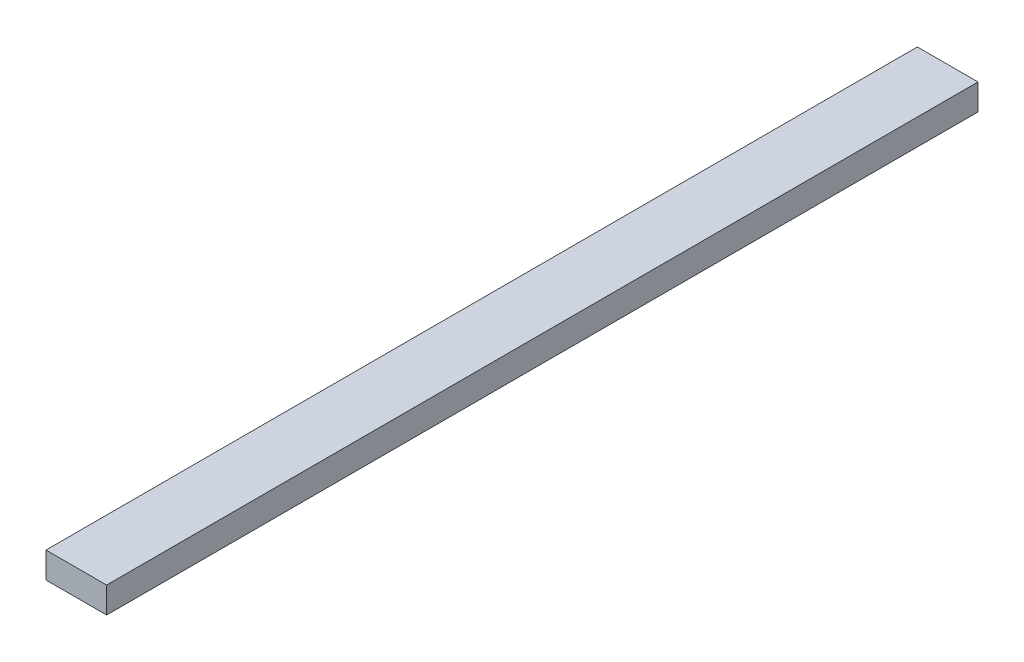
ISO-10303-21;
HEADER;
FILE_DESCRIPTION(('STEP AP214'),'2;1');
FILE_NAME('part.step','',(''),(''),'','','');
FILE_SCHEMA(('AUTOMOTIVE_DESIGN { 1 0 10303 214 1 1 1 1 }'));
ENDSEC;
DATA;
#1=APPLICATION_CONTEXT('core data for automotive mechanical design processes');
#2=APPLICATION_PROTOCOL_DEFINITION('international standard','automotive_design',2000,#1);
#3=PRODUCT_CONTEXT('',#1,'mechanical');
#4=PRODUCT('Part','Part','',(#3));
#5=PRODUCT_RELATED_PRODUCT_CATEGORY('part','',(#4));
#6=PRODUCT_DEFINITION_FORMATION('','',#4);
#7=PRODUCT_DEFINITION_CONTEXT('part definition',#1,'design');
#8=PRODUCT_DEFINITION('design','',#6,#7);
#9=PRODUCT_DEFINITION_SHAPE('','',#8);
#10=(LENGTH_UNIT() NAMED_UNIT(*) SI_UNIT(.MILLI.,.METRE.));
#11=(NAMED_UNIT(*) PLANE_ANGLE_UNIT() SI_UNIT($,.RADIAN.));
#12=(NAMED_UNIT(*) SI_UNIT($,.STERADIAN.) SOLID_ANGLE_UNIT());
#13=UNCERTAINTY_MEASURE_WITH_UNIT(LENGTH_MEASURE(1.E-05),#10,'distance_accuracy_value','');
#14=(GEOMETRIC_REPRESENTATION_CONTEXT(3) GLOBAL_UNCERTAINTY_ASSIGNED_CONTEXT((#13)) GLOBAL_UNIT_ASSIGNED_CONTEXT((#10,
#11,#12)) REPRESENTATION_CONTEXT('',''));
#15=CARTESIAN_POINT('',(0.,0.,0.));
#16=DIRECTION('',(0.,0.,1.));
#17=DIRECTION('',(1.,0.,0.));
#18=AXIS2_PLACEMENT_3D('',#15,#16,#17);
#19=CARTESIAN_POINT('',(-44.4500000000001,0.,638.899999947));
#20=DIRECTION('',(0.,-1.,0.));
#21=DIRECTION('',(1.,0.,0.));
#22=AXIS2_PLACEMENT_3D('',#19,#20,#21);
#23=PLANE('',#22);
#24=DIRECTION('',(-1.,0.,0.));
#25=VECTOR('',#24,1.);
#26=CARTESIAN_POINT('',(-44.4500000000001,0.,-638.899999947));
#27=LINE('',#26,#25);
#28=CARTESIAN_POINT('',(44.4500000000001,0.,-638.899999947));
#29=VERTEX_POINT('',#28);
#30=CARTESIAN_POINT('',(-44.4500000000001,0.,-638.899999947));
#31=VERTEX_POINT('',#30);
#32=EDGE_CURVE('E97',#29,#31,#27,.T.);
#33=ORIENTED_EDGE('',*,*,#32,.T.);
#34=DIRECTION('',(0.,0.,-1.));
#35=VECTOR('',#34,1.);
#36=CARTESIAN_POINT('',(-44.4500000000001,0.,638.899999947));
#37=LINE('',#36,#35);
#38=CARTESIAN_POINT('',(-44.4500000000001,0.,638.899999947));
#39=VERTEX_POINT('',#38);
#40=EDGE_CURVE('E11',#39,#31,#37,.T.);
#41=ORIENTED_EDGE('',*,*,#40,.F.);
#42=DIRECTION('',(-1.,0.,0.));
#43=VECTOR('',#42,1.);
#44=CARTESIAN_POINT('',(-44.4500000000001,0.,638.899999947));
#45=LINE('',#44,#43);
#46=CARTESIAN_POINT('',(44.4500000000001,0.,638.899999947));
#47=VERTEX_POINT('',#46);
#48=EDGE_CURVE('E85',#47,#39,#45,.T.);
#49=ORIENTED_EDGE('',*,*,#48,.F.);
#50=DIRECTION('',(0.,0.,-1.));
#51=VECTOR('',#50,1.);
#52=CARTESIAN_POINT('',(44.4500000000001,0.,638.899999947));
#53=LINE('',#52,#51);
#54=EDGE_CURVE('E93',#47,#29,#53,.T.);
#55=ORIENTED_EDGE('',*,*,#54,.T.);
#56=EDGE_LOOP('',(#33,#41,#49,#55));
#57=FACE_BOUND('',#56,.T.);
#58=ADVANCED_FACE('F34',(#57),#23,.F.);
#59=CARTESIAN_POINT('',(-44.4500000000001,-38.0999999999999,638.899999947));
#60=DIRECTION('',(1.,0.,0.));
#61=DIRECTION('',(0.,0.,-1.));
#62=AXIS2_PLACEMENT_3D('',#59,#60,#61);
#63=PLANE('',#62);
#64=DIRECTION('',(0.,-1.,0.));
#65=VECTOR('',#64,1.);
#66=CARTESIAN_POINT('',(-44.4500000000001,-38.0999999999999,-638.899999947));
#67=LINE('',#66,#65);
#68=CARTESIAN_POINT('',(-44.4500000000001,-38.0999999999999,-638.899999947));
#69=VERTEX_POINT('',#68);
#70=EDGE_CURVE('E89',#31,#69,#67,.T.);
#71=ORIENTED_EDGE('',*,*,#70,.T.);
#72=DIRECTION('',(0.,0.,-1.));
#73=VECTOR('',#72,1.);
#74=CARTESIAN_POINT('',(-44.4500000000001,-38.0999999999999,638.899999947));
#75=LINE('',#74,#73);
#76=CARTESIAN_POINT('',(-44.4500000000001,-38.0999999999999,638.899999947));
#77=VERTEX_POINT('',#76);
#78=EDGE_CURVE('E42',#77,#69,#75,.T.);
#79=ORIENTED_EDGE('',*,*,#78,.F.);
#80=DIRECTION('',(0.,-1.,0.));
#81=VECTOR('',#80,1.);
#82=CARTESIAN_POINT('',(-44.4500000000001,-38.0999999999999,638.899999947));
#83=LINE('',#82,#81);
#84=EDGE_CURVE('E80',#39,#77,#83,.T.);
#85=ORIENTED_EDGE('',*,*,#84,.F.);
#86=ORIENTED_EDGE('',*,*,#40,.T.);
#87=EDGE_LOOP('',(#71,#79,#85,#86));
#88=FACE_BOUND('',#87,.T.);
#89=ADVANCED_FACE('F88',(#88),#63,.F.);
#90=CARTESIAN_POINT('',(44.4500000000001,-38.0999999999999,638.899999947));
#91=DIRECTION('',(0.,1.,0.));
#92=DIRECTION('',(-1.,0.,0.));
#93=AXIS2_PLACEMENT_3D('',#90,#91,#92);
#94=PLANE('',#93);
#95=DIRECTION('',(1.,0.,0.));
#96=VECTOR('',#95,1.);
#97=CARTESIAN_POINT('',(44.4500000000001,-38.0999999999999,-638.899999947));
#98=LINE('',#97,#96);
#99=CARTESIAN_POINT('',(44.4500000000001,-38.0999999999999,-638.899999947));
#100=VERTEX_POINT('',#99);
#101=EDGE_CURVE('E67',#69,#100,#98,.T.);
#102=ORIENTED_EDGE('',*,*,#101,.T.);
#103=DIRECTION('',(0.,0.,-1.));
#104=VECTOR('',#103,1.);
#105=CARTESIAN_POINT('',(44.4500000000001,-38.0999999999999,638.899999947));
#106=LINE('',#105,#104);
#107=CARTESIAN_POINT('',(44.4500000000001,-38.0999999999999,638.899999947));
#108=VERTEX_POINT('',#107);
#109=EDGE_CURVE('E90',#108,#100,#106,.T.);
#110=ORIENTED_EDGE('',*,*,#109,.F.);
#111=DIRECTION('',(1.,0.,0.));
#112=VECTOR('',#111,1.);
#113=CARTESIAN_POINT('',(44.4500000000001,-38.0999999999999,638.899999947));
#114=LINE('',#113,#112);
#115=EDGE_CURVE('E83',#77,#108,#114,.T.);
#116=ORIENTED_EDGE('',*,*,#115,.F.);
#117=ORIENTED_EDGE('',*,*,#78,.T.);
#118=EDGE_LOOP('',(#102,#110,#116,#117));
#119=FACE_BOUND('',#118,.T.);
#120=ADVANCED_FACE('F91',(#119),#94,.F.);
#121=CARTESIAN_POINT('',(44.4500000000001,0.,638.899999947));
#122=DIRECTION('',(-1.,0.,0.));
#123=DIRECTION('',(0.,0.,1.));
#124=AXIS2_PLACEMENT_3D('',#121,#122,#123);
#125=PLANE('',#124);
#126=DIRECTION('',(0.,1.,0.));
#127=VECTOR('',#126,1.);
#128=CARTESIAN_POINT('',(44.4500000000001,0.,-638.899999947));
#129=LINE('',#128,#127);
#130=EDGE_CURVE('E73',#100,#29,#129,.T.);
#131=ORIENTED_EDGE('',*,*,#130,.T.);
#132=ORIENTED_EDGE('',*,*,#54,.F.);
#133=DIRECTION('',(0.,1.,0.));
#134=VECTOR('',#133,1.);
#135=CARTESIAN_POINT('',(44.4500000000001,0.,638.899999947));
#136=LINE('',#135,#134);
#137=EDGE_CURVE('E50',#108,#47,#136,.T.);
#138=ORIENTED_EDGE('',*,*,#137,.F.);
#139=ORIENTED_EDGE('',*,*,#109,.T.);
#140=EDGE_LOOP('',(#131,#132,#138,#139));
#141=FACE_BOUND('',#140,.T.);
#142=ADVANCED_FACE('F104',(#141),#125,.F.);
#143=CARTESIAN_POINT('',(0.,0.,638.899999947));
#144=DIRECTION('',(0.,0.,-1.));
#145=DIRECTION('',(-1.,0.,0.));
#146=AXIS2_PLACEMENT_3D('',#143,#144,#145);
#147=PLANE('',#146);
#148=ORIENTED_EDGE('',*,*,#48,.T.);
#149=ORIENTED_EDGE('',*,*,#84,.T.);
#150=ORIENTED_EDGE('',*,*,#115,.T.);
#151=ORIENTED_EDGE('',*,*,#137,.T.);
#152=EDGE_LOOP('',(#148,#149,#150,#151));
#153=FACE_BOUND('',#152,.T.);
#154=ADVANCED_FACE('F81',(#153),#147,.F.);
#155=CARTESIAN_POINT('',(0.,0.,-638.899999947));
#156=DIRECTION('',(0.,0.,-1.));
#157=DIRECTION('',(-1.,0.,0.));
#158=AXIS2_PLACEMENT_3D('',#155,#156,#157);
#159=PLANE('',#158);
#160=ORIENTED_EDGE('',*,*,#32,.F.);
#161=ORIENTED_EDGE('',*,*,#130,.F.);
#162=ORIENTED_EDGE('',*,*,#101,.F.);
#163=ORIENTED_EDGE('',*,*,#70,.F.);
#164=EDGE_LOOP('',(#160,#161,#162,#163));
#165=FACE_BOUND('',#164,.T.);
#166=ADVANCED_FACE('F107',(#165),#159,.T.);
#167=CLOSED_SHELL('',(#58,#89,#120,#142,#154,#166));
#168=MANIFOLD_SOLID_BREP('B2',#167);
#169=ADVANCED_BREP_SHAPE_REPRESENTATION('',(#18,#168),#14);
#170=SHAPE_DEFINITION_REPRESENTATION(#9,#169);
ENDSEC;
END-ISO-10303-21;
